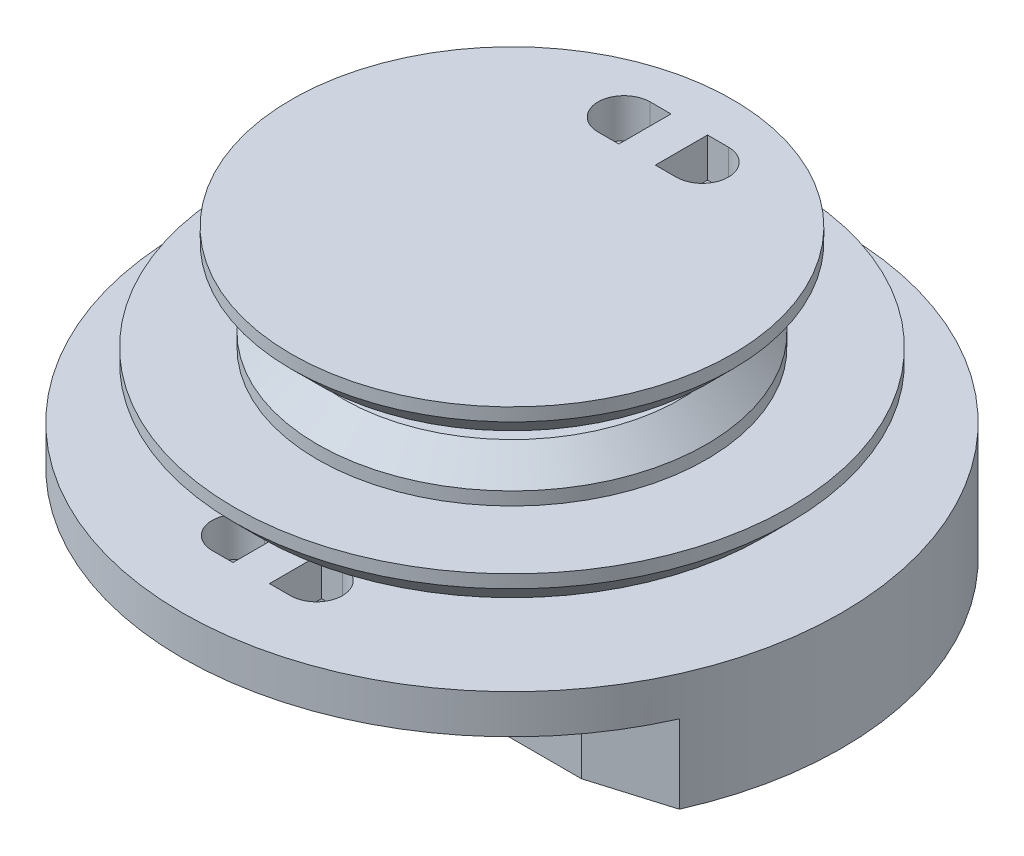
ISO-10303-21;
HEADER;
FILE_DESCRIPTION(('STEP AP214'),'2;1');
FILE_NAME('part.step','',(''),(''),'','','');
FILE_SCHEMA(('AUTOMOTIVE_DESIGN { 1 0 10303 214 1 1 1 1 }'));
ENDSEC;
DATA;
#1=APPLICATION_CONTEXT('core data for automotive mechanical design processes');
#2=APPLICATION_PROTOCOL_DEFINITION('international standard','automotive_design',2000,#1);
#3=PRODUCT_CONTEXT('',#1,'mechanical');
#4=PRODUCT('Part','Part','',(#3));
#5=PRODUCT_RELATED_PRODUCT_CATEGORY('part','',(#4));
#6=PRODUCT_DEFINITION_FORMATION('','',#4);
#7=PRODUCT_DEFINITION_CONTEXT('part definition',#1,'design');
#8=PRODUCT_DEFINITION('design','',#6,#7);
#9=PRODUCT_DEFINITION_SHAPE('','',#8);
#10=(LENGTH_UNIT() NAMED_UNIT(*) SI_UNIT(.MILLI.,.METRE.));
#11=(NAMED_UNIT(*) PLANE_ANGLE_UNIT() SI_UNIT($,.RADIAN.));
#12=(NAMED_UNIT(*) SI_UNIT($,.STERADIAN.) SOLID_ANGLE_UNIT());
#13=UNCERTAINTY_MEASURE_WITH_UNIT(LENGTH_MEASURE(1.E-05),#10,'distance_accuracy_value','');
#14=(GEOMETRIC_REPRESENTATION_CONTEXT(3) GLOBAL_UNCERTAINTY_ASSIGNED_CONTEXT((#13)) GLOBAL_UNIT_ASSIGNED_CONTEXT((#10,
#11,#12)) REPRESENTATION_CONTEXT('',''));
#15=CARTESIAN_POINT('',(0.,0.,0.));
#16=DIRECTION('',(0.,0.,1.));
#17=DIRECTION('',(1.,0.,0.));
#18=AXIS2_PLACEMENT_3D('',#15,#16,#17);
#19=CARTESIAN_POINT('',(0.,8.,0.));
#20=DIRECTION('',(0.,1.,0.));
#21=DIRECTION('',(0.,0.,1.));
#22=AXIS2_PLACEMENT_3D('',#19,#20,#21);
#23=PLANE('',#22);
#24=CARTESIAN_POINT('',(0.,8.,0.));
#25=DIRECTION('',(0.,1.,0.));
#26=DIRECTION('',(0.,0.,1.));
#27=AXIS2_PLACEMENT_3D('',#24,#25,#26);
#28=CIRCLE('',#27,8.45859872611465);
#29=CARTESIAN_POINT('',(0.,8.,8.45859872611465));
#30=VERTEX_POINT('',#29);
#31=EDGE_CURVE('E342',#30,#30,#28,.T.);
#32=ORIENTED_EDGE('',*,*,#31,.T.);
#33=EDGE_LOOP('',(#32));
#34=FACE_BOUND('',#33,.T.);
#35=DIRECTION('',(-1.,0.,0.));
#36=VECTOR('',#35,1.);
#37=CARTESIAN_POINT('',(0.,8.,-4.8));
#38=LINE('',#37,#36);
#39=CARTESIAN_POINT('',(-0.7,8.,-4.8));
#40=VERTEX_POINT('',#39);
#41=CARTESIAN_POINT('',(-1.5,8.,-4.8));
#42=VERTEX_POINT('',#41);
#43=EDGE_CURVE('E224',#40,#42,#38,.T.);
#44=ORIENTED_EDGE('',*,*,#43,.T.);
#45=CARTESIAN_POINT('',(-1.5,8.,-5.8));
#46=DIRECTION('',(0.,1.,0.));
#47=DIRECTION('',(0.,0.,1.));
#48=AXIS2_PLACEMENT_3D('',#45,#46,#47);
#49=CIRCLE('',#48,1.);
#50=CARTESIAN_POINT('',(-1.5,8.,-6.8));
#51=VERTEX_POINT('',#50);
#52=EDGE_CURVE('E220',#42,#51,#49,.F.);
#53=ORIENTED_EDGE('',*,*,#52,.T.);
#54=DIRECTION('',(-1.,0.,0.));
#55=VECTOR('',#54,1.);
#56=CARTESIAN_POINT('',(0.,8.,-6.8));
#57=LINE('',#56,#55);
#58=CARTESIAN_POINT('',(-0.7,8.,-6.8));
#59=VERTEX_POINT('',#58);
#60=EDGE_CURVE('E233',#59,#51,#57,.T.);
#61=ORIENTED_EDGE('',*,*,#60,.F.);
#62=DIRECTION('',(0.,0.,1.));
#63=VECTOR('',#62,1.);
#64=CARTESIAN_POINT('',(-0.7,8.,0.));
#65=LINE('',#64,#63);
#66=EDGE_CURVE('E229',#59,#40,#65,.T.);
#67=ORIENTED_EDGE('',*,*,#66,.T.);
#68=EDGE_LOOP('',(#44,#53,#61,#67));
#69=FACE_BOUND('',#68,.T.);
#70=DIRECTION('',(-1.,0.,0.));
#71=VECTOR('',#70,1.);
#72=CARTESIAN_POINT('',(0.,8.,-6.8));
#73=LINE('',#72,#71);
#74=CARTESIAN_POINT('',(1.5,8.,-6.8));
#75=VERTEX_POINT('',#74);
#76=CARTESIAN_POINT('',(0.7,8.,-6.8));
#77=VERTEX_POINT('',#76);
#78=EDGE_CURVE('E196',#75,#77,#73,.T.);
#79=ORIENTED_EDGE('',*,*,#78,.F.);
#80=CARTESIAN_POINT('',(1.5,8.,-5.8));
#81=DIRECTION('',(0.,1.,0.));
#82=DIRECTION('',(0.,0.,1.));
#83=AXIS2_PLACEMENT_3D('',#80,#81,#82);
#84=CIRCLE('',#83,1.);
#85=CARTESIAN_POINT('',(1.5,8.,-4.8));
#86=VERTEX_POINT('',#85);
#87=EDGE_CURVE('E202',#75,#86,#84,.F.);
#88=ORIENTED_EDGE('',*,*,#87,.T.);
#89=DIRECTION('',(-1.,0.,0.));
#90=VECTOR('',#89,1.);
#91=CARTESIAN_POINT('',(0.,8.,-4.8));
#92=LINE('',#91,#90);
#93=CARTESIAN_POINT('',(0.7,8.,-4.8));
#94=VERTEX_POINT('',#93);
#95=EDGE_CURVE('E205',#86,#94,#92,.T.);
#96=ORIENTED_EDGE('',*,*,#95,.T.);
#97=DIRECTION('',(0.,0.,1.));
#98=VECTOR('',#97,1.);
#99=CARTESIAN_POINT('',(0.7,8.,0.));
#100=LINE('',#99,#98);
#101=EDGE_CURVE('E184',#77,#94,#100,.T.);
#102=ORIENTED_EDGE('',*,*,#101,.F.);
#103=EDGE_LOOP('',(#79,#88,#96,#102));
#104=FACE_BOUND('',#103,.T.);
#105=ADVANCED_FACE('F43',(#34,#69,#104),#23,.T.);
#106=CARTESIAN_POINT('',(0.,6.5,0.));
#107=DIRECTION('',(0.,-1.,0.));
#108=DIRECTION('',(0.,0.,-1.));
#109=AXIS2_PLACEMENT_3D('',#106,#107,#108);
#110=PLANE('',#109);
#111=CARTESIAN_POINT('',(0.,6.5,0.));
#112=DIRECTION('',(0.,-1.,0.));
#113=DIRECTION('',(0.,0.,-1.));
#114=AXIS2_PLACEMENT_3D('',#111,#112,#113);
#115=CIRCLE('',#114,7.45859872611464);
#116=CARTESIAN_POINT('',(0.,6.5,-7.45859872611464));
#117=VERTEX_POINT('',#116);
#118=EDGE_CURVE('E416',#117,#117,#115,.T.);
#119=ORIENTED_EDGE('',*,*,#118,.T.);
#120=EDGE_LOOP('',(#119));
#121=FACE_BOUND('',#120,.T.);
#122=CARTESIAN_POINT('',(0.,6.5,0.));
#123=DIRECTION('',(0.,1.,0.));
#124=DIRECTION('',(0.,0.,1.));
#125=AXIS2_PLACEMENT_3D('',#122,#123,#124);
#126=CIRCLE('',#125,4.45859872611465);
#127=CARTESIAN_POINT('',(0.,6.5,4.45859872611465));
#128=VERTEX_POINT('',#127);
#129=EDGE_CURVE('E338',#128,#128,#126,.T.);
#130=ORIENTED_EDGE('',*,*,#129,.T.);
#131=EDGE_LOOP('',(#130));
#132=FACE_BOUND('',#131,.T.);
#133=DIRECTION('',(1.,0.,0.));
#134=VECTOR('',#133,1.);
#135=CARTESIAN_POINT('',(0.,6.5,-6.8));
#136=LINE('',#135,#134);
#137=CARTESIAN_POINT('',(-1.5,6.5,-6.8));
#138=VERTEX_POINT('',#137);
#139=CARTESIAN_POINT('',(-0.7,6.5,-6.8));
#140=VERTEX_POINT('',#139);
#141=EDGE_CURVE('E376',#138,#140,#136,.T.);
#142=ORIENTED_EDGE('',*,*,#141,.F.);
#143=CARTESIAN_POINT('',(-1.5,6.5,-5.8));
#144=DIRECTION('',(0.,-1.,0.));
#145=DIRECTION('',(0.,0.,-1.));
#146=AXIS2_PLACEMENT_3D('',#143,#144,#145);
#147=CIRCLE('',#146,1.);
#148=CARTESIAN_POINT('',(-1.5,6.5,-4.8));
#149=VERTEX_POINT('',#148);
#150=EDGE_CURVE('E379',#138,#149,#147,.F.);
#151=ORIENTED_EDGE('',*,*,#150,.T.);
#152=DIRECTION('',(1.,0.,0.));
#153=VECTOR('',#152,1.);
#154=CARTESIAN_POINT('',(0.,6.5,-4.8));
#155=LINE('',#154,#153);
#156=CARTESIAN_POINT('',(-0.7,6.5,-4.8));
#157=VERTEX_POINT('',#156);
#158=EDGE_CURVE('E368',#149,#157,#155,.T.);
#159=ORIENTED_EDGE('',*,*,#158,.T.);
#160=DIRECTION('',(0.,0.,-1.));
#161=VECTOR('',#160,1.);
#162=CARTESIAN_POINT('',(-0.7,6.5,0.));
#163=LINE('',#162,#161);
#164=EDGE_CURVE('E372',#157,#140,#163,.T.);
#165=ORIENTED_EDGE('',*,*,#164,.T.);
#166=EDGE_LOOP('',(#142,#151,#159,#165));
#167=FACE_BOUND('',#166,.T.);
#168=DIRECTION('',(1.,0.,0.));
#169=VECTOR('',#168,1.);
#170=CARTESIAN_POINT('',(0.,6.5,-4.8));
#171=LINE('',#170,#169);
#172=CARTESIAN_POINT('',(0.7,6.5,-4.8));
#173=VERTEX_POINT('',#172);
#174=CARTESIAN_POINT('',(1.5,6.5,-4.8));
#175=VERTEX_POINT('',#174);
#176=EDGE_CURVE('E388',#173,#175,#171,.T.);
#177=ORIENTED_EDGE('',*,*,#176,.T.);
#178=CARTESIAN_POINT('',(1.5,6.5,-5.8));
#179=DIRECTION('',(0.,-1.,0.));
#180=DIRECTION('',(0.,0.,-1.));
#181=AXIS2_PLACEMENT_3D('',#178,#179,#180);
#182=CIRCLE('',#181,1.);
#183=CARTESIAN_POINT('',(1.5,6.5,-6.8));
#184=VERTEX_POINT('',#183);
#185=EDGE_CURVE('E392',#175,#184,#182,.F.);
#186=ORIENTED_EDGE('',*,*,#185,.T.);
#187=DIRECTION('',(1.,0.,0.));
#188=VECTOR('',#187,1.);
#189=CARTESIAN_POINT('',(0.,6.5,-6.8));
#190=LINE('',#189,#188);
#191=CARTESIAN_POINT('',(0.7,6.5,-6.8));
#192=VERTEX_POINT('',#191);
#193=EDGE_CURVE('E383',#192,#184,#190,.T.);
#194=ORIENTED_EDGE('',*,*,#193,.F.);
#195=DIRECTION('',(0.,0.,-1.));
#196=VECTOR('',#195,1.);
#197=CARTESIAN_POINT('',(0.7,6.5,0.));
#198=LINE('',#197,#196);
#199=EDGE_CURVE('E187',#173,#192,#198,.T.);
#200=ORIENTED_EDGE('',*,*,#199,.F.);
#201=EDGE_LOOP('',(#177,#186,#194,#200));
#202=FACE_BOUND('',#201,.T.);
#203=ADVANCED_FACE('F484',(#121,#132,#167,#202),#110,.T.);
#204=CARTESIAN_POINT('',(0.,1.5,0.));
#205=DIRECTION('',(0.,1.,0.));
#206=DIRECTION('',(0.,0.,1.));
#207=AXIS2_PLACEMENT_3D('',#204,#205,#206);
#208=PLANE('',#207);
#209=DIRECTION('',(-1.,0.,0.));
#210=VECTOR('',#209,1.);
#211=CARTESIAN_POINT('',(0.,1.5,8.));
#212=LINE('',#211,#210);
#213=CARTESIAN_POINT('',(1.50000000000001,1.5,8.));
#214=VERTEX_POINT('',#213);
#215=CARTESIAN_POINT('',(0.7,1.5,8.));
#216=VERTEX_POINT('',#215);
#217=EDGE_CURVE('E316',#214,#216,#212,.T.);
#218=ORIENTED_EDGE('',*,*,#217,.F.);
#219=CARTESIAN_POINT('',(1.49999999999999,1.5,9.));
#220=DIRECTION('',(0.,1.,0.));
#221=DIRECTION('',(0.,0.,1.));
#222=AXIS2_PLACEMENT_3D('',#219,#220,#221);
#223=CIRCLE('',#222,0.999999999999997);
#224=CARTESIAN_POINT('',(1.49999999999999,1.5,10.));
#225=VERTEX_POINT('',#224);
#226=EDGE_CURVE('E271',#225,#214,#223,.T.);
#227=ORIENTED_EDGE('',*,*,#226,.F.);
#228=DIRECTION('',(-1.,0.,0.));
#229=VECTOR('',#228,1.);
#230=CARTESIAN_POINT('',(0.,1.5,10.));
#231=LINE('',#230,#229);
#232=CARTESIAN_POINT('',(0.7,1.5,10.));
#233=VERTEX_POINT('',#232);
#234=EDGE_CURVE('E309',#225,#233,#231,.T.);
#235=ORIENTED_EDGE('',*,*,#234,.T.);
#236=DIRECTION('',(0.,0.,1.));
#237=VECTOR('',#236,1.);
#238=CARTESIAN_POINT('',(0.7,1.5,0.));
#239=LINE('',#238,#237);
#240=EDGE_CURVE('E313',#216,#233,#239,.T.);
#241=ORIENTED_EDGE('',*,*,#240,.F.);
#242=EDGE_LOOP('',(#218,#227,#235,#241));
#243=FACE_BOUND('',#242,.T.);
#244=CARTESIAN_POINT('',(0.,1.5,0.));
#245=DIRECTION('',(0.,1.,0.));
#246=DIRECTION('',(0.,0.,1.));
#247=AXIS2_PLACEMENT_3D('',#244,#245,#246);
#248=CIRCLE('',#247,12.6433121019108);
#249=CARTESIAN_POINT('',(0.,1.5,12.6433121019108));
#250=VERTEX_POINT('',#249);
#251=EDGE_CURVE('E356',#250,#250,#248,.T.);
#252=ORIENTED_EDGE('',*,*,#251,.T.);
#253=EDGE_LOOP('',(#252));
#254=FACE_BOUND('',#253,.T.);
#255=CARTESIAN_POINT('',(0.,1.5,0.));
#256=DIRECTION('',(0.,1.,0.));
#257=DIRECTION('',(0.,0.,1.));
#258=AXIS2_PLACEMENT_3D('',#255,#256,#257);
#259=CIRCLE('',#258,7.64331210191083);
#260=CARTESIAN_POINT('',(0.,1.5,7.64331210191083));
#261=VERTEX_POINT('',#260);
#262=EDGE_CURVE('E360',#261,#261,#259,.T.);
#263=ORIENTED_EDGE('',*,*,#262,.F.);
#264=EDGE_LOOP('',(#263));
#265=FACE_BOUND('',#264,.T.);
#266=DIRECTION('',(0.,0.,1.));
#267=VECTOR('',#266,1.);
#268=CARTESIAN_POINT('',(-0.7,1.5,0.));
#269=LINE('',#268,#267);
#270=CARTESIAN_POINT('',(-0.7,1.5,8.));
#271=VERTEX_POINT('',#270);
#272=CARTESIAN_POINT('',(-0.7,1.5,10.));
#273=VERTEX_POINT('',#272);
#274=EDGE_CURVE('E326',#271,#273,#269,.T.);
#275=ORIENTED_EDGE('',*,*,#274,.T.);
#276=DIRECTION('',(-1.,0.,0.));
#277=VECTOR('',#276,1.);
#278=CARTESIAN_POINT('',(0.,1.5,10.));
#279=LINE('',#278,#277);
#280=CARTESIAN_POINT('',(-1.50000000000001,1.5,10.));
#281=VERTEX_POINT('',#280);
#282=EDGE_CURVE('E330',#273,#281,#279,.T.);
#283=ORIENTED_EDGE('',*,*,#282,.T.);
#284=CARTESIAN_POINT('',(-1.50000000000001,1.5,9.));
#285=DIRECTION('',(0.,1.,0.));
#286=DIRECTION('',(0.,0.,1.));
#287=AXIS2_PLACEMENT_3D('',#284,#285,#286);
#288=CIRCLE('',#287,0.999999999999997);
#289=CARTESIAN_POINT('',(-1.50000000000001,1.5,8.));
#290=VERTEX_POINT('',#289);
#291=EDGE_CURVE('E319',#290,#281,#288,.T.);
#292=ORIENTED_EDGE('',*,*,#291,.F.);
#293=DIRECTION('',(-1.,0.,0.));
#294=VECTOR('',#293,1.);
#295=CARTESIAN_POINT('',(0.,1.5,8.));
#296=LINE('',#295,#294);
#297=EDGE_CURVE('E322',#271,#290,#296,.T.);
#298=ORIENTED_EDGE('',*,*,#297,.F.);
#299=EDGE_LOOP('',(#275,#283,#292,#298));
#300=FACE_BOUND('',#299,.T.);
#301=ADVANCED_FACE('F486',(#243,#254,#265,#300),#208,.T.);
#302=CARTESIAN_POINT('',(0.,0.,0.));
#303=DIRECTION('',(0.,1.,0.));
#304=DIRECTION('',(0.,0.,1.));
#305=AXIS2_PLACEMENT_3D('',#302,#303,#304);
#306=PLANE('',#305);
#307=CARTESIAN_POINT('',(0.,0.,0.));
#308=DIRECTION('',(0.,1.,0.));
#309=DIRECTION('',(0.,0.,1.));
#310=AXIS2_PLACEMENT_3D('',#307,#308,#309);
#311=CIRCLE('',#310,12.6433121019108);
#312=CARTESIAN_POINT('',(-11.9233542152571,0.,4.20558737441463));
#313=VERTEX_POINT('',#312);
#314=CARTESIAN_POINT('',(11.5537166253084,0.,5.13468334451095));
#315=VERTEX_POINT('',#314);
#316=EDGE_CURVE('E60',#313,#315,#311,.T.);
#317=ORIENTED_EDGE('',*,*,#316,.F.);
#318=DIRECTION('',(-0.707106781186549,0.,-0.707106781186546));
#319=VECTOR('',#318,1.);
#320=CARTESIAN_POINT('',(-8.06447079483583,0.,8.06447079483587));
#321=LINE('',#320,#319);
#322=CARTESIAN_POINT('',(-10.1289415896717,0.,6.));
#323=VERTEX_POINT('',#322);
#324=EDGE_CURVE('E11',#313,#323,#321,.F.);
#325=ORIENTED_EDGE('',*,*,#324,.T.);
#326=DIRECTION('',(1.,0.,0.));
#327=VECTOR('',#326,1.);
#328=CARTESIAN_POINT('',(0.,0.,6.));
#329=LINE('',#328,#327);
#330=CARTESIAN_POINT('',(8.66384974160485,0.,6.));
#331=VERTEX_POINT('',#330);
#332=EDGE_CURVE('E444',#323,#331,#329,.T.);
#333=ORIENTED_EDGE('',*,*,#332,.T.);
#334=DIRECTION('',(-0.957976094790432,0.,0.28684804655091));
#335=VECTOR('',#334,1.);
#336=CARTESIAN_POINT('',(2.36163859594961,0.,7.88707940199494));
#337=LINE('',#336,#335);
#338=EDGE_CURVE('E53',#331,#315,#337,.F.);
#339=ORIENTED_EDGE('',*,*,#338,.T.);
#340=EDGE_LOOP('',(#317,#325,#333,#339));
#341=FACE_BOUND('',#340,.T.);
#342=CARTESIAN_POINT('',(1.49999999999999,0.,9.));
#343=DIRECTION('',(0.,-1.,0.));
#344=DIRECTION('',(0.,0.,-1.));
#345=AXIS2_PLACEMENT_3D('',#342,#343,#344);
#346=CIRCLE('',#345,0.999999999999997);
#347=CARTESIAN_POINT('',(1.50000000000001,0.,8.));
#348=VERTEX_POINT('',#347);
#349=CARTESIAN_POINT('',(1.50000000000001,0.,10.));
#350=VERTEX_POINT('',#349);
#351=EDGE_CURVE('E283',#348,#350,#346,.T.);
#352=ORIENTED_EDGE('',*,*,#351,.F.);
#353=DIRECTION('',(1.,0.,0.));
#354=VECTOR('',#353,1.);
#355=CARTESIAN_POINT('',(0.,0.,8.));
#356=LINE('',#355,#354);
#357=CARTESIAN_POINT('',(0.7,0.,8.));
#358=VERTEX_POINT('',#357);
#359=EDGE_CURVE('E215',#358,#348,#356,.T.);
#360=ORIENTED_EDGE('',*,*,#359,.F.);
#361=DIRECTION('',(0.,0.,-1.));
#362=VECTOR('',#361,1.);
#363=CARTESIAN_POINT('',(0.7,0.,0.));
#364=LINE('',#363,#362);
#365=CARTESIAN_POINT('',(0.7,0.,10.));
#366=VERTEX_POINT('',#365);
#367=EDGE_CURVE('E291',#366,#358,#364,.T.);
#368=ORIENTED_EDGE('',*,*,#367,.F.);
#369=DIRECTION('',(1.,0.,0.));
#370=VECTOR('',#369,1.);
#371=CARTESIAN_POINT('',(0.,0.,10.));
#372=LINE('',#371,#370);
#373=EDGE_CURVE('E287',#366,#350,#372,.T.);
#374=ORIENTED_EDGE('',*,*,#373,.T.);
#375=EDGE_LOOP('',(#352,#360,#368,#374));
#376=FACE_BOUND('',#375,.T.);
#377=DIRECTION('',(1.,0.,0.));
#378=VECTOR('',#377,1.);
#379=CARTESIAN_POINT('',(0.,0.,10.));
#380=LINE('',#379,#378);
#381=CARTESIAN_POINT('',(-1.50000000000001,0.,10.));
#382=VERTEX_POINT('',#381);
#383=CARTESIAN_POINT('',(-0.7,0.,10.));
#384=VERTEX_POINT('',#383);
#385=EDGE_CURVE('E250',#382,#384,#380,.T.);
#386=ORIENTED_EDGE('',*,*,#385,.T.);
#387=DIRECTION('',(0.,0.,-1.));
#388=VECTOR('',#387,1.);
#389=CARTESIAN_POINT('',(-0.7,0.,0.));
#390=LINE('',#389,#388);
#391=CARTESIAN_POINT('',(-0.7,0.,8.));
#392=VERTEX_POINT('',#391);
#393=EDGE_CURVE('E263',#384,#392,#390,.T.);
#394=ORIENTED_EDGE('',*,*,#393,.T.);
#395=DIRECTION('',(1.,0.,0.));
#396=VECTOR('',#395,1.);
#397=CARTESIAN_POINT('',(0.,0.,8.));
#398=LINE('',#397,#396);
#399=CARTESIAN_POINT('',(-1.50000000000001,0.,8.));
#400=VERTEX_POINT('',#399);
#401=EDGE_CURVE('E259',#400,#392,#398,.T.);
#402=ORIENTED_EDGE('',*,*,#401,.F.);
#403=CARTESIAN_POINT('',(-1.50000000000001,0.,9.));
#404=DIRECTION('',(0.,-1.,0.));
#405=DIRECTION('',(0.,0.,-1.));
#406=AXIS2_PLACEMENT_3D('',#403,#404,#405);
#407=CIRCLE('',#406,0.999999999999997);
#408=EDGE_CURVE('E254',#382,#400,#407,.T.);
#409=ORIENTED_EDGE('',*,*,#408,.F.);
#410=EDGE_LOOP('',(#386,#394,#402,#409));
#411=FACE_BOUND('',#410,.T.);
#412=ADVANCED_FACE('F441',(#341,#376,#411),#306,.F.);
#413=CARTESIAN_POINT('',(0.,4.,0.));
#414=DIRECTION('',(0.,-1.,0.));
#415=DIRECTION('',(0.,0.,-1.));
#416=AXIS2_PLACEMENT_3D('',#413,#414,#415);
#417=CYLINDRICAL_SURFACE('',#416,7.64331210191083);
#418=CARTESIAN_POINT('',(0.,2.5,0.));
#419=DIRECTION('',(0.,1.,0.));
#420=DIRECTION('',(0.,0.,1.));
#421=AXIS2_PLACEMENT_3D('',#418,#419,#420);
#422=CIRCLE('',#421,7.64331210191083);
#423=CARTESIAN_POINT('',(0.,2.5,7.64331210191083));
#424=VERTEX_POINT('',#423);
#425=EDGE_CURVE('E350',#424,#424,#422,.T.);
#426=ORIENTED_EDGE('',*,*,#425,.F.);
#427=EDGE_LOOP('',(#426));
#428=FACE_BOUND('',#427,.T.);
#429=ORIENTED_EDGE('',*,*,#262,.T.);
#430=EDGE_LOOP('',(#429));
#431=FACE_BOUND('',#430,.T.);
#432=ADVANCED_FACE('F522',(#428,#431),#417,.T.);
#433=CARTESIAN_POINT('',(0.,4.,0.));
#434=DIRECTION('',(0.,1.,0.));
#435=DIRECTION('',(0.,0.,1.));
#436=AXIS2_PLACEMENT_3D('',#433,#434,#435);
#437=CYLINDRICAL_SURFACE('',#436,12.6433121019108);
#438=ORIENTED_EDGE('',*,*,#316,.T.);
#439=DIRECTION('',(0.,1.,0.));
#440=VECTOR('',#439,1.);
#441=CARTESIAN_POINT('',(11.5537166253084,4.,5.13468334451095));
#442=LINE('',#441,#440);
#443=CARTESIAN_POINT('',(11.5537166253084,-3.,5.13468334451095));
#444=VERTEX_POINT('',#443);
#445=EDGE_CURVE('E430',#315,#444,#442,.F.);
#446=ORIENTED_EDGE('',*,*,#445,.T.);
#447=CARTESIAN_POINT('',(0.,-3.,0.));
#448=DIRECTION('',(0.,-1.,0.));
#449=DIRECTION('',(0.,0.,-1.));
#450=AXIS2_PLACEMENT_3D('',#447,#448,#449);
#451=CIRCLE('',#450,12.6433121019108);
#452=CARTESIAN_POINT('',(-11.9233542152571,-3.,4.20558737441463));
#453=VERTEX_POINT('',#452);
#454=EDGE_CURVE('E225',#453,#444,#451,.T.);
#455=ORIENTED_EDGE('',*,*,#454,.F.);
#456=DIRECTION('',(0.,1.,0.));
#457=VECTOR('',#456,1.);
#458=CARTESIAN_POINT('',(-11.9233542152571,4.,4.20558737441463));
#459=LINE('',#458,#457);
#460=EDGE_CURVE('E427',#453,#313,#459,.T.);
#461=ORIENTED_EDGE('',*,*,#460,.T.);
#462=EDGE_LOOP('',(#438,#446,#455,#461));
#463=FACE_BOUND('',#462,.T.);
#464=ORIENTED_EDGE('',*,*,#251,.F.);
#465=EDGE_LOOP('',(#464));
#466=FACE_BOUND('',#465,.T.);
#467=ADVANCED_FACE('F451',(#463,#466),#437,.T.);
#468=CARTESIAN_POINT('',(0.,4.,0.));
#469=DIRECTION('',(0.,1.,0.));
#470=DIRECTION('',(0.,0.,1.));
#471=AXIS2_PLACEMENT_3D('',#468,#469,#470);
#472=CYLINDRICAL_SURFACE('',#471,10.6433121019108);
#473=CARTESIAN_POINT('',(0.,3.49999999999999,0.));
#474=DIRECTION('',(0.,-1.,0.));
#475=DIRECTION('',(0.,0.,-1.));
#476=AXIS2_PLACEMENT_3D('',#473,#474,#475);
#477=CIRCLE('',#476,10.6433121019108);
#478=CARTESIAN_POINT('',(0.,3.49999999999999,-10.6433121019108));
#479=VERTEX_POINT('',#478);
#480=EDGE_CURVE('E396',#479,#479,#477,.F.);
#481=ORIENTED_EDGE('',*,*,#480,.T.);
#482=EDGE_LOOP('',(#481));
#483=FACE_BOUND('',#482,.T.);
#484=CARTESIAN_POINT('',(0.,4.,0.));
#485=DIRECTION('',(0.,1.,0.));
#486=DIRECTION('',(0.,0.,1.));
#487=AXIS2_PLACEMENT_3D('',#484,#485,#486);
#488=CIRCLE('',#487,10.6433121019108);
#489=CARTESIAN_POINT('',(0.,4.,10.6433121019108));
#490=VERTEX_POINT('',#489);
#491=EDGE_CURVE('E346',#490,#490,#488,.T.);
#492=ORIENTED_EDGE('',*,*,#491,.F.);
#493=EDGE_LOOP('',(#492));
#494=FACE_BOUND('',#493,.T.);
#495=ADVANCED_FACE('F516',(#483,#494),#472,.T.);
#496=CARTESIAN_POINT('',(0.,2.5,0.));
#497=DIRECTION('',(0.,-1.,0.));
#498=DIRECTION('',(0.,0.,-1.));
#499=AXIS2_PLACEMENT_3D('',#496,#497,#498);
#500=PLANE('',#499);
#501=CARTESIAN_POINT('',(0.,2.5,0.));
#502=DIRECTION('',(0.,-1.,0.));
#503=DIRECTION('',(0.,0.,-1.));
#504=AXIS2_PLACEMENT_3D('',#501,#502,#503);
#505=CIRCLE('',#504,9.64331210191083);
#506=CARTESIAN_POINT('',(0.,2.5,-9.64331210191083));
#507=VERTEX_POINT('',#506);
#508=EDGE_CURVE('E400',#507,#507,#505,.T.);
#509=ORIENTED_EDGE('',*,*,#508,.T.);
#510=EDGE_LOOP('',(#509));
#511=FACE_BOUND('',#510,.T.);
#512=ORIENTED_EDGE('',*,*,#425,.T.);
#513=EDGE_LOOP('',(#512));
#514=FACE_BOUND('',#513,.T.);
#515=ADVANCED_FACE('F512',(#511,#514),#500,.T.);
#516=CARTESIAN_POINT('',(0.,4.,0.));
#517=DIRECTION('',(0.,1.,0.));
#518=DIRECTION('',(0.,0.,1.));
#519=AXIS2_PLACEMENT_3D('',#516,#517,#518);
#520=PLANE('',#519);
#521=CARTESIAN_POINT('',(0.,4.,0.));
#522=DIRECTION('',(0.,1.,0.));
#523=DIRECTION('',(0.,0.,1.));
#524=AXIS2_PLACEMENT_3D('',#521,#522,#523);
#525=CIRCLE('',#524,7.45859872611465);
#526=CARTESIAN_POINT('',(0.,4.,7.45859872611465));
#527=VERTEX_POINT('',#526);
#528=EDGE_CURVE('E364',#527,#527,#525,.T.);
#529=ORIENTED_EDGE('',*,*,#528,.F.);
#530=EDGE_LOOP('',(#529));
#531=FACE_BOUND('',#530,.T.);
#532=ORIENTED_EDGE('',*,*,#491,.T.);
#533=EDGE_LOOP('',(#532));
#534=FACE_BOUND('',#533,.T.);
#535=ADVANCED_FACE('F515',(#531,#534),#520,.T.);
#536=CARTESIAN_POINT('',(0.,5.5,0.));
#537=DIRECTION('',(0.,1.,0.));
#538=DIRECTION('',(0.,0.,1.));
#539=AXIS2_PLACEMENT_3D('',#536,#537,#538);
#540=PLANE('',#539);
#541=CARTESIAN_POINT('',(0.,5.5,0.));
#542=DIRECTION('',(0.,1.,0.));
#543=DIRECTION('',(0.,0.,1.));
#544=AXIS2_PLACEMENT_3D('',#541,#542,#543);
#545=CIRCLE('',#544,6.45859872611465);
#546=CARTESIAN_POINT('',(0.,5.5,6.45859872611465));
#547=VERTEX_POINT('',#546);
#548=EDGE_CURVE('E404',#547,#547,#545,.T.);
#549=ORIENTED_EDGE('',*,*,#548,.T.);
#550=EDGE_LOOP('',(#549));
#551=FACE_BOUND('',#550,.T.);
#552=CARTESIAN_POINT('',(0.,5.5,0.));
#553=DIRECTION('',(0.,1.,0.));
#554=DIRECTION('',(0.,0.,1.));
#555=AXIS2_PLACEMENT_3D('',#552,#553,#554);
#556=CIRCLE('',#555,4.45859872611465);
#557=CARTESIAN_POINT('',(0.,5.5,4.45859872611465));
#558=VERTEX_POINT('',#557);
#559=EDGE_CURVE('E334',#558,#558,#556,.T.);
#560=ORIENTED_EDGE('',*,*,#559,.F.);
#561=EDGE_LOOP('',(#560));
#562=FACE_BOUND('',#561,.T.);
#563=ADVANCED_FACE('F500',(#551,#562),#540,.T.);
#564=CARTESIAN_POINT('',(0.,4.,0.));
#565=DIRECTION('',(0.,1.,0.));
#566=DIRECTION('',(0.,0.,1.));
#567=AXIS2_PLACEMENT_3D('',#564,#565,#566);
#568=CYLINDRICAL_SURFACE('',#567,7.45859872611465);
#569=CARTESIAN_POINT('',(0.,4.5,0.));
#570=DIRECTION('',(0.,1.,0.));
#571=DIRECTION('',(0.,0.,1.));
#572=AXIS2_PLACEMENT_3D('',#569,#570,#571);
#573=CIRCLE('',#572,7.45859872611465);
#574=CARTESIAN_POINT('',(0.,4.5,7.45859872611465));
#575=VERTEX_POINT('',#574);
#576=EDGE_CURVE('E408',#575,#575,#573,.F.);
#577=ORIENTED_EDGE('',*,*,#576,.T.);
#578=EDGE_LOOP('',(#577));
#579=FACE_BOUND('',#578,.T.);
#580=ORIENTED_EDGE('',*,*,#528,.T.);
#581=EDGE_LOOP('',(#580));
#582=FACE_BOUND('',#581,.T.);
#583=ADVANCED_FACE('F505',(#579,#582),#568,.T.);
#584=CARTESIAN_POINT('',(0.,4.,0.));
#585=DIRECTION('',(0.,1.,0.));
#586=DIRECTION('',(0.,0.,1.));
#587=AXIS2_PLACEMENT_3D('',#584,#585,#586);
#588=CYLINDRICAL_SURFACE('',#587,8.45859872611465);
#589=CARTESIAN_POINT('',(0.,7.5,0.));
#590=DIRECTION('',(0.,-1.,0.));
#591=DIRECTION('',(0.,0.,-1.));
#592=AXIS2_PLACEMENT_3D('',#589,#590,#591);
#593=CIRCLE('',#592,8.45859872611465);
#594=CARTESIAN_POINT('',(0.,7.5,-8.45859872611465));
#595=VERTEX_POINT('',#594);
#596=EDGE_CURVE('E412',#595,#595,#593,.F.);
#597=ORIENTED_EDGE('',*,*,#596,.T.);
#598=EDGE_LOOP('',(#597));
#599=FACE_BOUND('',#598,.T.);
#600=ORIENTED_EDGE('',*,*,#31,.F.);
#601=EDGE_LOOP('',(#600));
#602=FACE_BOUND('',#601,.T.);
#603=ADVANCED_FACE('F502',(#599,#602),#588,.T.);
#604=CARTESIAN_POINT('',(0.,8.,0.));
#605=DIRECTION('',(0.,-1.,0.));
#606=DIRECTION('',(0.,0.,-1.));
#607=AXIS2_PLACEMENT_3D('',#604,#605,#606);
#608=CYLINDRICAL_SURFACE('',#607,4.45859872611465);
#609=ORIENTED_EDGE('',*,*,#559,.T.);
#610=EDGE_LOOP('',(#609));
#611=FACE_BOUND('',#610,.T.);
#612=ORIENTED_EDGE('',*,*,#129,.F.);
#613=EDGE_LOOP('',(#612));
#614=FACE_BOUND('',#613,.T.);
#615=ADVANCED_FACE('F504',(#611,#614),#608,.T.);
#616=CARTESIAN_POINT('',(0.,2.,8.));
#617=DIRECTION('',(0.,0.,-1.));
#618=DIRECTION('',(-1.,0.,0.));
#619=AXIS2_PLACEMENT_3D('',#616,#617,#618);
#620=PLANE('',#619);
#621=ORIENTED_EDGE('',*,*,#217,.T.);
#622=DIRECTION('',(0.,-1.,0.));
#623=VECTOR('',#622,1.);
#624=CARTESIAN_POINT('',(0.7,2.,8.));
#625=LINE('',#624,#623);
#626=EDGE_CURVE('E255',#216,#358,#625,.T.);
#627=ORIENTED_EDGE('',*,*,#626,.T.);
#628=ORIENTED_EDGE('',*,*,#359,.T.);
#629=DIRECTION('',(0.,-1.,0.));
#630=VECTOR('',#629,1.);
#631=CARTESIAN_POINT('',(1.50000000000001,2.,8.));
#632=LINE('',#631,#630);
#633=EDGE_CURVE('E295',#214,#348,#632,.T.);
#634=ORIENTED_EDGE('',*,*,#633,.F.);
#635=EDGE_LOOP('',(#621,#627,#628,#634));
#636=FACE_BOUND('',#635,.T.);
#637=ADVANCED_FACE('F510',(#636),#620,.F.);
#638=CARTESIAN_POINT('',(0.7,2.,0.));
#639=DIRECTION('',(-1.,0.,0.));
#640=DIRECTION('',(0.,0.,1.));
#641=AXIS2_PLACEMENT_3D('',#638,#639,#640);
#642=PLANE('',#641);
#643=ORIENTED_EDGE('',*,*,#240,.T.);
#644=DIRECTION('',(0.,-1.,0.));
#645=VECTOR('',#644,1.);
#646=CARTESIAN_POINT('',(0.7,2.,10.));
#647=LINE('',#646,#645);
#648=EDGE_CURVE('E298',#233,#366,#647,.T.);
#649=ORIENTED_EDGE('',*,*,#648,.T.);
#650=ORIENTED_EDGE('',*,*,#367,.T.);
#651=ORIENTED_EDGE('',*,*,#626,.F.);
#652=EDGE_LOOP('',(#643,#649,#650,#651));
#653=FACE_BOUND('',#652,.T.);
#654=ADVANCED_FACE('F622',(#653),#642,.F.);
#655=CARTESIAN_POINT('',(0.,2.,10.));
#656=DIRECTION('',(0.,0.,-1.));
#657=DIRECTION('',(-1.,0.,0.));
#658=AXIS2_PLACEMENT_3D('',#655,#656,#657);
#659=PLANE('',#658);
#660=DIRECTION('',(0.,-1.,0.));
#661=VECTOR('',#660,1.);
#662=CARTESIAN_POINT('',(1.50000000000001,2.,10.));
#663=LINE('',#662,#661);
#664=EDGE_CURVE('E301',#225,#350,#663,.T.);
#665=ORIENTED_EDGE('',*,*,#664,.T.);
#666=ORIENTED_EDGE('',*,*,#373,.F.);
#667=ORIENTED_EDGE('',*,*,#648,.F.);
#668=ORIENTED_EDGE('',*,*,#234,.F.);
#669=EDGE_LOOP('',(#665,#666,#667,#668));
#670=FACE_BOUND('',#669,.T.);
#671=ADVANCED_FACE('F625',(#670),#659,.T.);
#672=CARTESIAN_POINT('',(1.49999999999999,2.,9.));
#673=DIRECTION('',(0.,-1.,0.));
#674=DIRECTION('',(0.,0.,-1.));
#675=AXIS2_PLACEMENT_3D('',#672,#673,#674);
#676=CYLINDRICAL_SURFACE('',#675,0.999999999999997);
#677=ORIENTED_EDGE('',*,*,#226,.T.);
#678=ORIENTED_EDGE('',*,*,#633,.T.);
#679=ORIENTED_EDGE('',*,*,#351,.T.);
#680=ORIENTED_EDGE('',*,*,#664,.F.);
#681=EDGE_LOOP('',(#677,#678,#679,#680));
#682=FACE_BOUND('',#681,.T.);
#683=ADVANCED_FACE('F620',(#682),#676,.F.);
#684=CARTESIAN_POINT('',(0.,2.,10.));
#685=DIRECTION('',(0.,0.,-1.));
#686=DIRECTION('',(-1.,0.,0.));
#687=AXIS2_PLACEMENT_3D('',#684,#685,#686);
#688=PLANE('',#687);
#689=DIRECTION('',(0.,-1.,0.));
#690=VECTOR('',#689,1.);
#691=CARTESIAN_POINT('',(-0.7,2.,10.));
#692=LINE('',#691,#690);
#693=EDGE_CURVE('E268',#273,#384,#692,.T.);
#694=ORIENTED_EDGE('',*,*,#693,.T.);
#695=ORIENTED_EDGE('',*,*,#385,.F.);
#696=DIRECTION('',(0.,-1.,0.));
#697=VECTOR('',#696,1.);
#698=CARTESIAN_POINT('',(-1.50000000000001,2.,10.));
#699=LINE('',#698,#697);
#700=EDGE_CURVE('E267',#281,#382,#699,.T.);
#701=ORIENTED_EDGE('',*,*,#700,.F.);
#702=ORIENTED_EDGE('',*,*,#282,.F.);
#703=EDGE_LOOP('',(#694,#695,#701,#702));
#704=FACE_BOUND('',#703,.T.);
#705=ADVANCED_FACE('F610',(#704),#688,.T.);
#706=CARTESIAN_POINT('',(-0.7,2.,0.));
#707=DIRECTION('',(-1.,0.,0.));
#708=DIRECTION('',(0.,0.,1.));
#709=AXIS2_PLACEMENT_3D('',#706,#707,#708);
#710=PLANE('',#709);
#711=DIRECTION('',(0.,-1.,0.));
#712=VECTOR('',#711,1.);
#713=CARTESIAN_POINT('',(-0.7,2.,8.));
#714=LINE('',#713,#712);
#715=EDGE_CURVE('E272',#271,#392,#714,.T.);
#716=ORIENTED_EDGE('',*,*,#715,.T.);
#717=ORIENTED_EDGE('',*,*,#393,.F.);
#718=ORIENTED_EDGE('',*,*,#693,.F.);
#719=ORIENTED_EDGE('',*,*,#274,.F.);
#720=EDGE_LOOP('',(#716,#717,#718,#719));
#721=FACE_BOUND('',#720,.T.);
#722=ADVANCED_FACE('F606',(#721),#710,.T.);
#723=CARTESIAN_POINT('',(0.,2.,8.));
#724=DIRECTION('',(0.,0.,-1.));
#725=DIRECTION('',(-1.,0.,0.));
#726=AXIS2_PLACEMENT_3D('',#723,#724,#725);
#727=PLANE('',#726);
#728=ORIENTED_EDGE('',*,*,#297,.T.);
#729=DIRECTION('',(0.,-1.,0.));
#730=VECTOR('',#729,1.);
#731=CARTESIAN_POINT('',(-1.50000000000001,2.,8.));
#732=LINE('',#731,#730);
#733=EDGE_CURVE('E275',#290,#400,#732,.T.);
#734=ORIENTED_EDGE('',*,*,#733,.T.);
#735=ORIENTED_EDGE('',*,*,#401,.T.);
#736=ORIENTED_EDGE('',*,*,#715,.F.);
#737=EDGE_LOOP('',(#728,#734,#735,#736));
#738=FACE_BOUND('',#737,.T.);
#739=ADVANCED_FACE('F609',(#738),#727,.F.);
#740=CARTESIAN_POINT('',(-1.50000000000001,2.,9.));
#741=DIRECTION('',(0.,-1.,0.));
#742=DIRECTION('',(0.,0.,-1.));
#743=AXIS2_PLACEMENT_3D('',#740,#741,#742);
#744=CYLINDRICAL_SURFACE('',#743,0.999999999999997);
#745=ORIENTED_EDGE('',*,*,#291,.T.);
#746=ORIENTED_EDGE('',*,*,#700,.T.);
#747=ORIENTED_EDGE('',*,*,#408,.T.);
#748=ORIENTED_EDGE('',*,*,#733,.F.);
#749=EDGE_LOOP('',(#745,#746,#747,#748));
#750=FACE_BOUND('',#749,.T.);
#751=ADVANCED_FACE('F604',(#750),#744,.F.);
#752=CARTESIAN_POINT('',(-1.5,6.,-5.8));
#753=DIRECTION('',(0.,1.,0.));
#754=DIRECTION('',(0.,0.,1.));
#755=AXIS2_PLACEMENT_3D('',#752,#753,#754);
#756=CYLINDRICAL_SURFACE('',#755,1.);
#757=DIRECTION('',(0.,1.,0.));
#758=VECTOR('',#757,1.);
#759=CARTESIAN_POINT('',(-1.5,6.,-6.8));
#760=LINE('',#759,#758);
#761=EDGE_CURVE('E238',#138,#51,#760,.T.);
#762=ORIENTED_EDGE('',*,*,#761,.T.);
#763=ORIENTED_EDGE('',*,*,#52,.F.);
#764=DIRECTION('',(0.,1.,0.));
#765=VECTOR('',#764,1.);
#766=CARTESIAN_POINT('',(-1.5,6.,-4.8));
#767=LINE('',#766,#765);
#768=EDGE_CURVE('E237',#149,#42,#767,.T.);
#769=ORIENTED_EDGE('',*,*,#768,.F.);
#770=ORIENTED_EDGE('',*,*,#150,.F.);
#771=EDGE_LOOP('',(#762,#763,#769,#770));
#772=FACE_BOUND('',#771,.T.);
#773=ADVANCED_FACE('F594',(#772),#756,.F.);
#774=CARTESIAN_POINT('',(0.,6.,-6.8));
#775=DIRECTION('',(0.,0.,-1.));
#776=DIRECTION('',(-1.,0.,0.));
#777=AXIS2_PLACEMENT_3D('',#774,#775,#776);
#778=PLANE('',#777);
#779=ORIENTED_EDGE('',*,*,#141,.T.);
#780=DIRECTION('',(0.,1.,0.));
#781=VECTOR('',#780,1.);
#782=CARTESIAN_POINT('',(-0.7,6.,-6.8));
#783=LINE('',#782,#781);
#784=EDGE_CURVE('E241',#140,#59,#783,.T.);
#785=ORIENTED_EDGE('',*,*,#784,.T.);
#786=ORIENTED_EDGE('',*,*,#60,.T.);
#787=ORIENTED_EDGE('',*,*,#761,.F.);
#788=EDGE_LOOP('',(#779,#785,#786,#787));
#789=FACE_BOUND('',#788,.T.);
#790=ADVANCED_FACE('F590',(#789),#778,.F.);
#791=CARTESIAN_POINT('',(-0.7,6.,0.));
#792=DIRECTION('',(-1.,0.,0.));
#793=DIRECTION('',(0.,0.,1.));
#794=AXIS2_PLACEMENT_3D('',#791,#792,#793);
#795=PLANE('',#794);
#796=DIRECTION('',(0.,1.,0.));
#797=VECTOR('',#796,1.);
#798=CARTESIAN_POINT('',(-0.7,6.,-4.8));
#799=LINE('',#798,#797);
#800=EDGE_CURVE('E244',#157,#40,#799,.T.);
#801=ORIENTED_EDGE('',*,*,#800,.T.);
#802=ORIENTED_EDGE('',*,*,#66,.F.);
#803=ORIENTED_EDGE('',*,*,#784,.F.);
#804=ORIENTED_EDGE('',*,*,#164,.F.);
#805=EDGE_LOOP('',(#801,#802,#803,#804));
#806=FACE_BOUND('',#805,.T.);
#807=ADVANCED_FACE('F593',(#806),#795,.T.);
#808=CARTESIAN_POINT('',(0.,6.,-4.8));
#809=DIRECTION('',(0.,0.,-1.));
#810=DIRECTION('',(-1.,0.,0.));
#811=AXIS2_PLACEMENT_3D('',#808,#809,#810);
#812=PLANE('',#811);
#813=ORIENTED_EDGE('',*,*,#768,.T.);
#814=ORIENTED_EDGE('',*,*,#43,.F.);
#815=ORIENTED_EDGE('',*,*,#800,.F.);
#816=ORIENTED_EDGE('',*,*,#158,.F.);
#817=EDGE_LOOP('',(#813,#814,#815,#816));
#818=FACE_BOUND('',#817,.T.);
#819=ADVANCED_FACE('F589',(#818),#812,.T.);
#820=CARTESIAN_POINT('',(1.5,6.,-5.8));
#821=DIRECTION('',(0.,1.,0.));
#822=DIRECTION('',(0.,0.,1.));
#823=AXIS2_PLACEMENT_3D('',#820,#821,#822);
#824=CYLINDRICAL_SURFACE('',#823,1.);
#825=DIRECTION('',(0.,1.,0.));
#826=VECTOR('',#825,1.);
#827=CARTESIAN_POINT('',(1.5,6.,-4.8));
#828=LINE('',#827,#826);
#829=EDGE_CURVE('E212',#175,#86,#828,.T.);
#830=ORIENTED_EDGE('',*,*,#829,.T.);
#831=ORIENTED_EDGE('',*,*,#87,.F.);
#832=DIRECTION('',(0.,1.,0.));
#833=VECTOR('',#832,1.);
#834=CARTESIAN_POINT('',(1.5,6.,-6.8));
#835=LINE('',#834,#833);
#836=EDGE_CURVE('E192',#184,#75,#835,.T.);
#837=ORIENTED_EDGE('',*,*,#836,.F.);
#838=ORIENTED_EDGE('',*,*,#185,.F.);
#839=EDGE_LOOP('',(#830,#831,#837,#838));
#840=FACE_BOUND('',#839,.T.);
#841=ADVANCED_FACE('F479',(#840),#824,.F.);
#842=CARTESIAN_POINT('',(0.,6.,-4.8));
#843=DIRECTION('',(0.,0.,-1.));
#844=DIRECTION('',(-1.,0.,0.));
#845=AXIS2_PLACEMENT_3D('',#842,#843,#844);
#846=PLANE('',#845);
#847=DIRECTION('',(0.,1.,0.));
#848=VECTOR('',#847,1.);
#849=CARTESIAN_POINT('',(0.7,6.,-4.8));
#850=LINE('',#849,#848);
#851=EDGE_CURVE('E191',#173,#94,#850,.T.);
#852=ORIENTED_EDGE('',*,*,#851,.T.);
#853=ORIENTED_EDGE('',*,*,#95,.F.);
#854=ORIENTED_EDGE('',*,*,#829,.F.);
#855=ORIENTED_EDGE('',*,*,#176,.F.);
#856=EDGE_LOOP('',(#852,#853,#854,#855));
#857=FACE_BOUND('',#856,.T.);
#858=ADVANCED_FACE('F482',(#857),#846,.T.);
#859=CARTESIAN_POINT('',(0.7,6.,0.));
#860=DIRECTION('',(-1.,0.,0.));
#861=DIRECTION('',(0.,0.,1.));
#862=AXIS2_PLACEMENT_3D('',#859,#860,#861);
#863=PLANE('',#862);
#864=ORIENTED_EDGE('',*,*,#199,.T.);
#865=DIRECTION('',(0.,1.,0.));
#866=VECTOR('',#865,1.);
#867=CARTESIAN_POINT('',(0.7,6.,-6.8));
#868=LINE('',#867,#866);
#869=EDGE_CURVE('E179',#192,#77,#868,.T.);
#870=ORIENTED_EDGE('',*,*,#869,.T.);
#871=ORIENTED_EDGE('',*,*,#101,.T.);
#872=ORIENTED_EDGE('',*,*,#851,.F.);
#873=EDGE_LOOP('',(#864,#870,#871,#872));
#874=FACE_BOUND('',#873,.T.);
#875=ADVANCED_FACE('F181',(#874),#863,.F.);
#876=CARTESIAN_POINT('',(0.,6.,-6.8));
#877=DIRECTION('',(0.,0.,-1.));
#878=DIRECTION('',(-1.,0.,0.));
#879=AXIS2_PLACEMENT_3D('',#876,#877,#878);
#880=PLANE('',#879);
#881=ORIENTED_EDGE('',*,*,#193,.T.);
#882=ORIENTED_EDGE('',*,*,#836,.T.);
#883=ORIENTED_EDGE('',*,*,#78,.T.);
#884=ORIENTED_EDGE('',*,*,#869,.F.);
#885=EDGE_LOOP('',(#881,#882,#883,#884));
#886=FACE_BOUND('',#885,.T.);
#887=ADVANCED_FACE('F197',(#886),#880,.F.);
#888=CARTESIAN_POINT('',(0.,-3.,6.));
#889=DIRECTION('',(0.,0.,1.));
#890=DIRECTION('',(1.,0.,0.));
#891=AXIS2_PLACEMENT_3D('',#888,#889,#890);
#892=PLANE('',#891);
#893=DIRECTION('',(1.,0.,0.));
#894=VECTOR('',#893,1.);
#895=CARTESIAN_POINT('',(0.,-3.,6.));
#896=LINE('',#895,#894);
#897=CARTESIAN_POINT('',(-10.1289415896717,-3.,6.));
#898=VERTEX_POINT('',#897);
#899=CARTESIAN_POINT('',(8.66384974160485,-3.,6.));
#900=VERTEX_POINT('',#899);
#901=EDGE_CURVE('E460',#898,#900,#896,.T.);
#902=ORIENTED_EDGE('',*,*,#901,.T.);
#903=DIRECTION('',(0.,1.,0.));
#904=VECTOR('',#903,1.);
#905=CARTESIAN_POINT('',(8.66384974160485,-3.,6.));
#906=LINE('',#905,#904);
#907=EDGE_CURVE('E423',#900,#331,#906,.T.);
#908=ORIENTED_EDGE('',*,*,#907,.T.);
#909=ORIENTED_EDGE('',*,*,#332,.F.);
#910=DIRECTION('',(0.,-1.,0.));
#911=VECTOR('',#910,1.);
#912=CARTESIAN_POINT('',(-10.1289415896717,-3.,6.));
#913=LINE('',#912,#911);
#914=EDGE_CURVE('E420',#323,#898,#913,.T.);
#915=ORIENTED_EDGE('',*,*,#914,.T.);
#916=EDGE_LOOP('',(#902,#908,#909,#915));
#917=FACE_BOUND('',#916,.T.);
#918=ADVANCED_FACE('F566',(#917),#892,.T.);
#919=CARTESIAN_POINT('',(-7.25,-3.,0.));
#920=DIRECTION('',(0.,1.,0.));
#921=DIRECTION('',(0.,0.,1.));
#922=AXIS2_PLACEMENT_3D('',#919,#920,#921);
#923=CYLINDRICAL_SURFACE('',#922,0.5);
#924=CARTESIAN_POINT('',(-7.25,-3.,0.));
#925=DIRECTION('',(0.,-1.,0.));
#926=DIRECTION('',(0.,0.,-1.));
#927=AXIS2_PLACEMENT_3D('',#924,#925,#926);
#928=CIRCLE('',#927,0.5);
#929=CARTESIAN_POINT('',(-7.25,-3.,-0.5));
#930=VERTEX_POINT('',#929);
#931=EDGE_CURVE('E463',#930,#930,#928,.T.);
#932=ORIENTED_EDGE('',*,*,#931,.T.);
#933=EDGE_LOOP('',(#932));
#934=FACE_BOUND('',#933,.T.);
#935=CARTESIAN_POINT('',(-7.25,0.,0.));
#936=DIRECTION('',(0.,-1.,0.));
#937=DIRECTION('',(0.,0.,-1.));
#938=AXIS2_PLACEMENT_3D('',#935,#936,#937);
#939=CIRCLE('',#938,0.5);
#940=CARTESIAN_POINT('',(-7.25,0.,-0.5));
#941=VERTEX_POINT('',#940);
#942=EDGE_CURVE('E471',#941,#941,#939,.T.);
#943=ORIENTED_EDGE('',*,*,#942,.F.);
#944=EDGE_LOOP('',(#943));
#945=FACE_BOUND('',#944,.T.);
#946=ADVANCED_FACE('F568',(#934,#945),#923,.F.);
#947=CARTESIAN_POINT('',(7.25,-3.,0.));
#948=DIRECTION('',(0.,1.,0.));
#949=DIRECTION('',(0.,0.,1.));
#950=AXIS2_PLACEMENT_3D('',#947,#948,#949);
#951=CYLINDRICAL_SURFACE('',#950,0.5);
#952=CARTESIAN_POINT('',(7.25,-3.,0.));
#953=DIRECTION('',(0.,-1.,0.));
#954=DIRECTION('',(0.,0.,-1.));
#955=AXIS2_PLACEMENT_3D('',#952,#953,#954);
#956=CIRCLE('',#955,0.5);
#957=CARTESIAN_POINT('',(7.25,-3.,-0.5));
#958=VERTEX_POINT('',#957);
#959=EDGE_CURVE('E476',#958,#958,#956,.T.);
#960=ORIENTED_EDGE('',*,*,#959,.T.);
#961=EDGE_LOOP('',(#960));
#962=FACE_BOUND('',#961,.T.);
#963=CARTESIAN_POINT('',(7.25,0.,0.));
#964=DIRECTION('',(0.,-1.,0.));
#965=DIRECTION('',(0.,0.,-1.));
#966=AXIS2_PLACEMENT_3D('',#963,#964,#965);
#967=CIRCLE('',#966,0.5);
#968=CARTESIAN_POINT('',(7.25,0.,-0.5));
#969=VERTEX_POINT('',#968);
#970=EDGE_CURVE('E467',#969,#969,#967,.T.);
#971=ORIENTED_EDGE('',*,*,#970,.F.);
#972=EDGE_LOOP('',(#971));
#973=FACE_BOUND('',#972,.T.);
#974=ADVANCED_FACE('F574',(#962,#973),#951,.F.);
#975=CARTESIAN_POINT('',(0.,-3.,0.));
#976=DIRECTION('',(0.,-1.,0.));
#977=DIRECTION('',(0.,0.,-1.));
#978=AXIS2_PLACEMENT_3D('',#975,#976,#977);
#979=PLANE('',#978);
#980=ORIENTED_EDGE('',*,*,#959,.F.);
#981=EDGE_LOOP('',(#980));
#982=FACE_BOUND('',#981,.T.);
#983=ORIENTED_EDGE('',*,*,#931,.F.);
#984=EDGE_LOOP('',(#983));
#985=FACE_BOUND('',#984,.T.);
#986=ORIENTED_EDGE('',*,*,#454,.T.);
#987=DIRECTION('',(0.957976094790432,0.,-0.28684804655091));
#988=VECTOR('',#987,1.);
#989=CARTESIAN_POINT('',(2.36163859594961,-3.,7.88707940199494));
#990=LINE('',#989,#988);
#991=EDGE_CURVE('E436',#444,#900,#990,.F.);
#992=ORIENTED_EDGE('',*,*,#991,.T.);
#993=ORIENTED_EDGE('',*,*,#901,.F.);
#994=DIRECTION('',(0.707106781186549,0.,0.707106781186546));
#995=VECTOR('',#994,1.);
#996=CARTESIAN_POINT('',(-8.06447079483583,-3.,8.06447079483587));
#997=LINE('',#996,#995);
#998=EDGE_CURVE('E433',#898,#453,#997,.F.);
#999=ORIENTED_EDGE('',*,*,#998,.T.);
#1000=EDGE_LOOP('',(#986,#992,#993,#999));
#1001=FACE_BOUND('',#1000,.T.);
#1002=ADVANCED_FACE('F455',(#982,#985,#1001),#979,.T.);
#1003=ORIENTED_EDGE('',*,*,#942,.T.);
#1004=EDGE_LOOP('',(#1003));
#1005=FACE_BOUND('',#1004,.T.);
#1006=ADVANCED_FACE('F530',(#1005),#306,.F.);
#1007=ORIENTED_EDGE('',*,*,#970,.T.);
#1008=EDGE_LOOP('',(#1007));
#1009=FACE_BOUND('',#1008,.T.);
#1010=ADVANCED_FACE('F529',(#1009),#306,.F.);
#1011=CARTESIAN_POINT('',(0.,3.49999999999999,0.));
#1012=DIRECTION('',(0.,1.,0.));
#1013=DIRECTION('',(0.,0.,1.));
#1014=AXIS2_PLACEMENT_3D('',#1011,#1012,#1013);
#1015=CONICAL_SURFACE('',#1014,10.6433121019108,0.785398163397452);
#1016=ORIENTED_EDGE('',*,*,#508,.F.);
#1017=EDGE_LOOP('',(#1016));
#1018=FACE_BOUND('',#1017,.T.);
#1019=ORIENTED_EDGE('',*,*,#480,.F.);
#1020=EDGE_LOOP('',(#1019));
#1021=FACE_BOUND('',#1020,.T.);
#1022=ADVANCED_FACE('F535',(#1018,#1021),#1015,.T.);
#1023=CARTESIAN_POINT('',(0.,5.5,0.));
#1024=DIRECTION('',(0.,-1.,0.));
#1025=DIRECTION('',(0.,0.,-1.));
#1026=AXIS2_PLACEMENT_3D('',#1023,#1024,#1025);
#1027=CONICAL_SURFACE('',#1026,6.45859872611465,0.785398163397446);
#1028=ORIENTED_EDGE('',*,*,#576,.F.);
#1029=EDGE_LOOP('',(#1028));
#1030=FACE_BOUND('',#1029,.T.);
#1031=ORIENTED_EDGE('',*,*,#548,.F.);
#1032=EDGE_LOOP('',(#1031));
#1033=FACE_BOUND('',#1032,.T.);
#1034=ADVANCED_FACE('F541',(#1030,#1033),#1027,.T.);
#1035=CARTESIAN_POINT('',(0.,7.5,0.));
#1036=DIRECTION('',(0.,1.,0.));
#1037=DIRECTION('',(0.,0.,1.));
#1038=AXIS2_PLACEMENT_3D('',#1035,#1036,#1037);
#1039=CONICAL_SURFACE('',#1038,8.45859872611465,0.785398163397451);
#1040=ORIENTED_EDGE('',*,*,#118,.F.);
#1041=EDGE_LOOP('',(#1040));
#1042=FACE_BOUND('',#1041,.T.);
#1043=ORIENTED_EDGE('',*,*,#596,.F.);
#1044=EDGE_LOOP('',(#1043));
#1045=FACE_BOUND('',#1044,.T.);
#1046=ADVANCED_FACE('F548',(#1042,#1045),#1039,.T.);
#1047=CARTESIAN_POINT('',(8.66384974160485,4.,6.));
#1048=DIRECTION('',(-0.28684804655091,0.,-0.957976094790432));
#1049=DIRECTION('',(0.,1.,0.));
#1050=AXIS2_PLACEMENT_3D('',#1047,#1048,#1049);
#1051=PLANE('',#1050);
#1052=ORIENTED_EDGE('',*,*,#991,.F.);
#1053=ORIENTED_EDGE('',*,*,#445,.F.);
#1054=ORIENTED_EDGE('',*,*,#338,.F.);
#1055=ORIENTED_EDGE('',*,*,#907,.F.);
#1056=EDGE_LOOP('',(#1052,#1053,#1054,#1055));
#1057=FACE_BOUND('',#1056,.T.);
#1058=ADVANCED_FACE('F448',(#1057),#1051,.F.);
#1059=CARTESIAN_POINT('',(-11.9233542152571,4.,4.20558737441463));
#1060=DIRECTION('',(0.707106781186546,0.,-0.707106781186549));
#1061=DIRECTION('',(0.,1.,0.));
#1062=AXIS2_PLACEMENT_3D('',#1059,#1060,#1061);
#1063=PLANE('',#1062);
#1064=ORIENTED_EDGE('',*,*,#998,.F.);
#1065=ORIENTED_EDGE('',*,*,#914,.F.);
#1066=ORIENTED_EDGE('',*,*,#324,.F.);
#1067=ORIENTED_EDGE('',*,*,#460,.F.);
#1068=EDGE_LOOP('',(#1064,#1065,#1066,#1067));
#1069=FACE_BOUND('',#1068,.T.);
#1070=ADVANCED_FACE('F46',(#1069),#1063,.F.);
#1071=CLOSED_SHELL('',(#105,#203,#301,#412,#432,#467,#495,#515,#535,#563,#583,#603,#615,#637,
#654,#671,#683,#705,#722,#739,#751,#773,#790,#807,#819,#841,#858,#875,#887,#918,#946,#974,#1002,
#1006,#1010,#1022,#1034,#1046,#1058,#1070));
#1072=MANIFOLD_SOLID_BREP('B2',#1071);
#1073=ADVANCED_BREP_SHAPE_REPRESENTATION('',(#18,#1072),#14);
#1074=SHAPE_DEFINITION_REPRESENTATION(#9,#1073);
ENDSEC;
END-ISO-10303-21;
